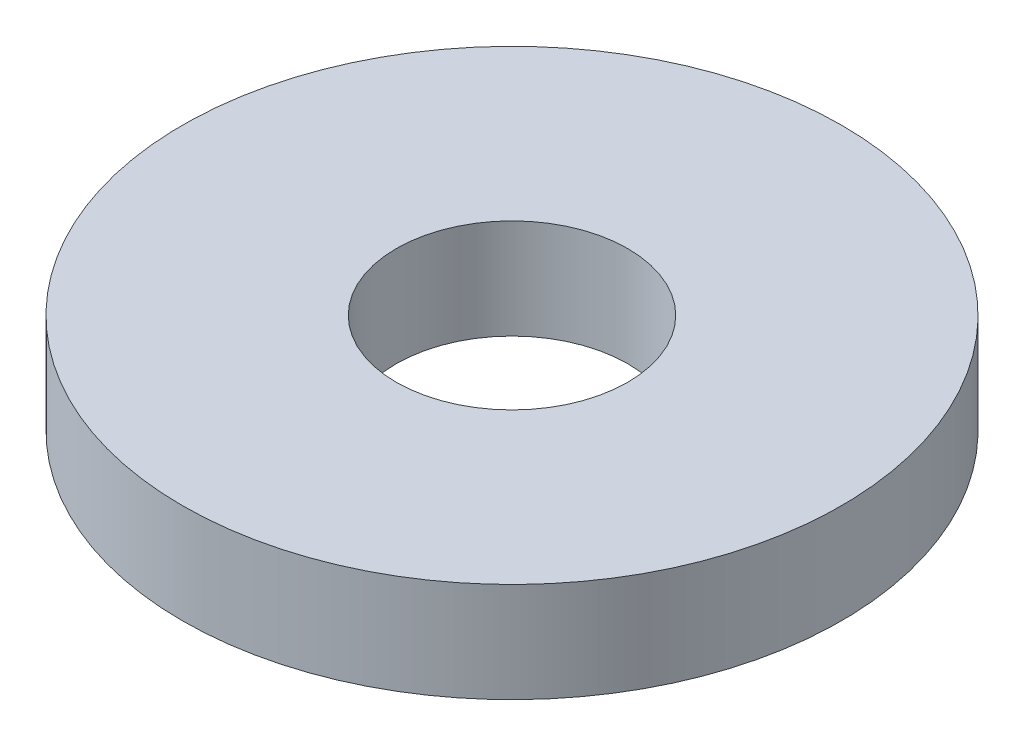
ISO-10303-21;
HEADER;
FILE_DESCRIPTION(('STEP AP214'),'2;1');
FILE_NAME('part.step','',(''),(''),'','','');
FILE_SCHEMA(('AUTOMOTIVE_DESIGN { 1 0 10303 214 1 1 1 1 }'));
ENDSEC;
DATA;
#1=APPLICATION_CONTEXT('core data for automotive mechanical design processes');
#2=APPLICATION_PROTOCOL_DEFINITION('international standard','automotive_design',2000,#1);
#3=PRODUCT_CONTEXT('',#1,'mechanical');
#4=PRODUCT('Part','Part','',(#3));
#5=PRODUCT_RELATED_PRODUCT_CATEGORY('part','',(#4));
#6=PRODUCT_DEFINITION_FORMATION('','',#4);
#7=PRODUCT_DEFINITION_CONTEXT('part definition',#1,'design');
#8=PRODUCT_DEFINITION('design','',#6,#7);
#9=PRODUCT_DEFINITION_SHAPE('','',#8);
#10=(LENGTH_UNIT() NAMED_UNIT(*) SI_UNIT(.MILLI.,.METRE.));
#11=(NAMED_UNIT(*) PLANE_ANGLE_UNIT() SI_UNIT($,.RADIAN.));
#12=(NAMED_UNIT(*) SI_UNIT($,.STERADIAN.) SOLID_ANGLE_UNIT());
#13=UNCERTAINTY_MEASURE_WITH_UNIT(LENGTH_MEASURE(1.E-05),#10,'distance_accuracy_value','');
#14=(GEOMETRIC_REPRESENTATION_CONTEXT(3) GLOBAL_UNCERTAINTY_ASSIGNED_CONTEXT((#13)) GLOBAL_UNIT_ASSIGNED_CONTEXT((#10,
#11,#12)) REPRESENTATION_CONTEXT('',''));
#15=CARTESIAN_POINT('',(0.,0.,0.));
#16=DIRECTION('',(0.,0.,1.));
#17=DIRECTION('',(1.,0.,0.));
#18=AXIS2_PLACEMENT_3D('',#15,#16,#17);
#19=CARTESIAN_POINT('',(0.,28.,0.));
#20=DIRECTION('',(0.,-1.,0.));
#21=DIRECTION('',(0.,0.,-1.));
#22=AXIS2_PLACEMENT_3D('',#19,#20,#21);
#23=CYLINDRICAL_SURFACE('',#22,92.5);
#24=CARTESIAN_POINT('',(0.,28.,0.));
#25=DIRECTION('',(0.,1.,0.));
#26=DIRECTION('',(0.,0.,1.));
#27=AXIS2_PLACEMENT_3D('',#24,#25,#26);
#28=CIRCLE('',#27,92.5);
#29=CARTESIAN_POINT('',(0.,28.,92.5));
#30=VERTEX_POINT('',#29);
#31=EDGE_CURVE('E10',#30,#30,#28,.T.);
#32=ORIENTED_EDGE('',*,*,#31,.F.);
#33=EDGE_LOOP('',(#32));
#34=FACE_BOUND('',#33,.T.);
#35=CARTESIAN_POINT('',(0.,0.,0.));
#36=DIRECTION('',(0.,1.,0.));
#37=DIRECTION('',(0.,0.,1.));
#38=AXIS2_PLACEMENT_3D('',#35,#36,#37);
#39=CIRCLE('',#38,92.5);
#40=CARTESIAN_POINT('',(0.,0.,92.5));
#41=VERTEX_POINT('',#40);
#42=EDGE_CURVE('E37',#41,#41,#39,.T.);
#43=ORIENTED_EDGE('',*,*,#42,.T.);
#44=EDGE_LOOP('',(#43));
#45=FACE_BOUND('',#44,.T.);
#46=ADVANCED_FACE('F40',(#34,#45),#23,.T.);
#47=CARTESIAN_POINT('',(0.,28.,0.));
#48=DIRECTION('',(0.,1.,0.));
#49=DIRECTION('',(0.,0.,1.));
#50=AXIS2_PLACEMENT_3D('',#47,#48,#49);
#51=PLANE('',#50);
#52=CARTESIAN_POINT('',(0.,28.,0.));
#53=DIRECTION('',(0.,1.,0.));
#54=DIRECTION('',(0.,0.,1.));
#55=AXIS2_PLACEMENT_3D('',#52,#53,#54);
#56=CIRCLE('',#55,32.5);
#57=CARTESIAN_POINT('',(0.,28.,32.5));
#58=VERTEX_POINT('',#57);
#59=EDGE_CURVE('E50',#58,#58,#56,.T.);
#60=ORIENTED_EDGE('',*,*,#59,.F.);
#61=EDGE_LOOP('',(#60));
#62=FACE_BOUND('',#61,.T.);
#63=ORIENTED_EDGE('',*,*,#31,.T.);
#64=EDGE_LOOP('',(#63));
#65=FACE_BOUND('',#64,.T.);
#66=ADVANCED_FACE('F59',(#62,#65),#51,.T.);
#67=CARTESIAN_POINT('',(0.,0.,0.));
#68=DIRECTION('',(0.,1.,0.));
#69=DIRECTION('',(0.,0.,1.));
#70=AXIS2_PLACEMENT_3D('',#67,#68,#69);
#71=PLANE('',#70);
#72=CARTESIAN_POINT('',(0.,0.,0.));
#73=DIRECTION('',(0.,1.,0.));
#74=DIRECTION('',(0.,0.,1.));
#75=AXIS2_PLACEMENT_3D('',#72,#73,#74);
#76=CIRCLE('',#75,32.5);
#77=CARTESIAN_POINT('',(0.,0.,32.5));
#78=VERTEX_POINT('',#77);
#79=EDGE_CURVE('E47',#78,#78,#76,.T.);
#80=ORIENTED_EDGE('',*,*,#79,.T.);
#81=EDGE_LOOP('',(#80));
#82=FACE_BOUND('',#81,.T.);
#83=ORIENTED_EDGE('',*,*,#42,.F.);
#84=EDGE_LOOP('',(#83));
#85=FACE_BOUND('',#84,.T.);
#86=ADVANCED_FACE('F58',(#82,#85),#71,.F.);
#87=CARTESIAN_POINT('',(0.,28.,0.));
#88=DIRECTION('',(0.,-1.,0.));
#89=DIRECTION('',(0.,0.,-1.));
#90=AXIS2_PLACEMENT_3D('',#87,#88,#89);
#91=CYLINDRICAL_SURFACE('',#90,32.5);
#92=ORIENTED_EDGE('',*,*,#59,.T.);
#93=EDGE_LOOP('',(#92));
#94=FACE_BOUND('',#93,.T.);
#95=ORIENTED_EDGE('',*,*,#79,.F.);
#96=EDGE_LOOP('',(#95));
#97=FACE_BOUND('',#96,.T.);
#98=ADVANCED_FACE('F54',(#94,#97),#91,.F.);
#99=CLOSED_SHELL('',(#46,#66,#86,#98));
#100=MANIFOLD_SOLID_BREP('B2',#99);
#101=ADVANCED_BREP_SHAPE_REPRESENTATION('',(#18,#100),#14);
#102=SHAPE_DEFINITION_REPRESENTATION(#9,#101);
ENDSEC;
END-ISO-10303-21;
